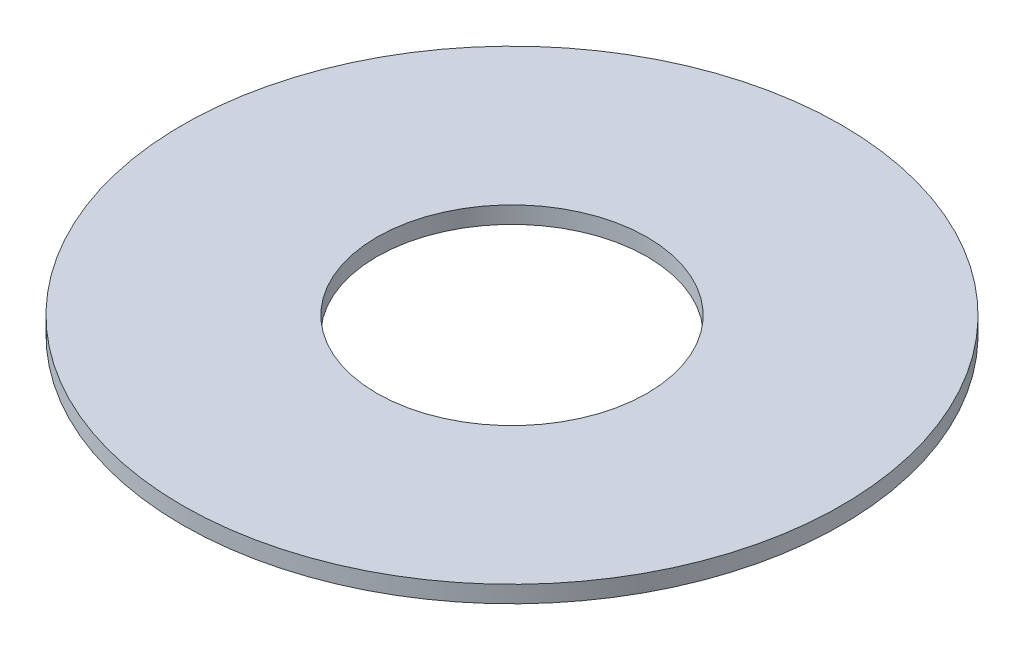
ISO-10303-21;
HEADER;
FILE_DESCRIPTION(('STEP AP214'),'2;1');
FILE_NAME('part.step','',(''),(''),'','','');
FILE_SCHEMA(('AUTOMOTIVE_DESIGN { 1 0 10303 214 1 1 1 1 }'));
ENDSEC;
DATA;
#1=APPLICATION_CONTEXT('core data for automotive mechanical design processes');
#2=APPLICATION_PROTOCOL_DEFINITION('international standard','automotive_design',2000,#1);
#3=PRODUCT_CONTEXT('',#1,'mechanical');
#4=PRODUCT('Part','Part','',(#3));
#5=PRODUCT_RELATED_PRODUCT_CATEGORY('part','',(#4));
#6=PRODUCT_DEFINITION_FORMATION('','',#4);
#7=PRODUCT_DEFINITION_CONTEXT('part definition',#1,'design');
#8=PRODUCT_DEFINITION('design','',#6,#7);
#9=PRODUCT_DEFINITION_SHAPE('','',#8);
#10=(LENGTH_UNIT() NAMED_UNIT(*) SI_UNIT(.MILLI.,.METRE.));
#11=(NAMED_UNIT(*) PLANE_ANGLE_UNIT() SI_UNIT($,.RADIAN.));
#12=(NAMED_UNIT(*) SI_UNIT($,.STERADIAN.) SOLID_ANGLE_UNIT());
#13=UNCERTAINTY_MEASURE_WITH_UNIT(LENGTH_MEASURE(1.E-05),#10,'distance_accuracy_value','');
#14=(GEOMETRIC_REPRESENTATION_CONTEXT(3) GLOBAL_UNCERTAINTY_ASSIGNED_CONTEXT((#13)) GLOBAL_UNIT_ASSIGNED_CONTEXT((#10,
#11,#12)) REPRESENTATION_CONTEXT('',''));
#15=CARTESIAN_POINT('',(0.,0.,0.));
#16=DIRECTION('',(0.,0.,1.));
#17=DIRECTION('',(1.,0.,0.));
#18=AXIS2_PLACEMENT_3D('',#15,#16,#17);
#19=CARTESIAN_POINT('',(0.,5.,0.));
#20=DIRECTION('',(0.,-1.,0.));
#21=DIRECTION('',(0.,0.,-1.));
#22=AXIS2_PLACEMENT_3D('',#19,#20,#21);
#23=CYLINDRICAL_SURFACE('',#22,97.5);
#24=CARTESIAN_POINT('',(0.,5.,0.));
#25=DIRECTION('',(0.,1.,0.));
#26=DIRECTION('',(0.,0.,1.));
#27=AXIS2_PLACEMENT_3D('',#24,#25,#26);
#28=CIRCLE('',#27,97.5);
#29=CARTESIAN_POINT('',(0.,5.,97.5));
#30=VERTEX_POINT('',#29);
#31=EDGE_CURVE('E10',#30,#30,#28,.T.);
#32=ORIENTED_EDGE('',*,*,#31,.F.);
#33=EDGE_LOOP('',(#32));
#34=FACE_BOUND('',#33,.T.);
#35=CARTESIAN_POINT('',(0.,0.,0.));
#36=DIRECTION('',(0.,1.,0.));
#37=DIRECTION('',(0.,0.,1.));
#38=AXIS2_PLACEMENT_3D('',#35,#36,#37);
#39=CIRCLE('',#38,97.5);
#40=CARTESIAN_POINT('',(0.,0.,97.5));
#41=VERTEX_POINT('',#40);
#42=EDGE_CURVE('E37',#41,#41,#39,.T.);
#43=ORIENTED_EDGE('',*,*,#42,.T.);
#44=EDGE_LOOP('',(#43));
#45=FACE_BOUND('',#44,.T.);
#46=ADVANCED_FACE('F40',(#34,#45),#23,.T.);
#47=CARTESIAN_POINT('',(0.,5.,0.));
#48=DIRECTION('',(0.,1.,0.));
#49=DIRECTION('',(0.,0.,1.));
#50=AXIS2_PLACEMENT_3D('',#47,#48,#49);
#51=PLANE('',#50);
#52=CARTESIAN_POINT('',(0.,5.,0.));
#53=DIRECTION('',(0.,1.,0.));
#54=DIRECTION('',(0.,0.,1.));
#55=AXIS2_PLACEMENT_3D('',#52,#53,#54);
#56=CIRCLE('',#55,40.);
#57=CARTESIAN_POINT('',(0.,5.,40.));
#58=VERTEX_POINT('',#57);
#59=EDGE_CURVE('E50',#58,#58,#56,.T.);
#60=ORIENTED_EDGE('',*,*,#59,.F.);
#61=EDGE_LOOP('',(#60));
#62=FACE_BOUND('',#61,.T.);
#63=ORIENTED_EDGE('',*,*,#31,.T.);
#64=EDGE_LOOP('',(#63));
#65=FACE_BOUND('',#64,.T.);
#66=ADVANCED_FACE('F59',(#62,#65),#51,.T.);
#67=CARTESIAN_POINT('',(0.,0.,0.));
#68=DIRECTION('',(0.,1.,0.));
#69=DIRECTION('',(0.,0.,1.));
#70=AXIS2_PLACEMENT_3D('',#67,#68,#69);
#71=PLANE('',#70);
#72=CARTESIAN_POINT('',(0.,0.,0.));
#73=DIRECTION('',(0.,1.,0.));
#74=DIRECTION('',(0.,0.,1.));
#75=AXIS2_PLACEMENT_3D('',#72,#73,#74);
#76=CIRCLE('',#75,40.);
#77=CARTESIAN_POINT('',(0.,0.,40.));
#78=VERTEX_POINT('',#77);
#79=EDGE_CURVE('E47',#78,#78,#76,.T.);
#80=ORIENTED_EDGE('',*,*,#79,.T.);
#81=EDGE_LOOP('',(#80));
#82=FACE_BOUND('',#81,.T.);
#83=ORIENTED_EDGE('',*,*,#42,.F.);
#84=EDGE_LOOP('',(#83));
#85=FACE_BOUND('',#84,.T.);
#86=ADVANCED_FACE('F58',(#82,#85),#71,.F.);
#87=CARTESIAN_POINT('',(0.,5.,0.));
#88=DIRECTION('',(0.,-1.,0.));
#89=DIRECTION('',(0.,0.,-1.));
#90=AXIS2_PLACEMENT_3D('',#87,#88,#89);
#91=CYLINDRICAL_SURFACE('',#90,40.);
#92=ORIENTED_EDGE('',*,*,#59,.T.);
#93=EDGE_LOOP('',(#92));
#94=FACE_BOUND('',#93,.T.);
#95=ORIENTED_EDGE('',*,*,#79,.F.);
#96=EDGE_LOOP('',(#95));
#97=FACE_BOUND('',#96,.T.);
#98=ADVANCED_FACE('F54',(#94,#97),#91,.F.);
#99=CLOSED_SHELL('',(#46,#66,#86,#98));
#100=MANIFOLD_SOLID_BREP('B2',#99);
#101=ADVANCED_BREP_SHAPE_REPRESENTATION('',(#18,#100),#14);
#102=SHAPE_DEFINITION_REPRESENTATION(#9,#101);
ENDSEC;
END-ISO-10303-21;
